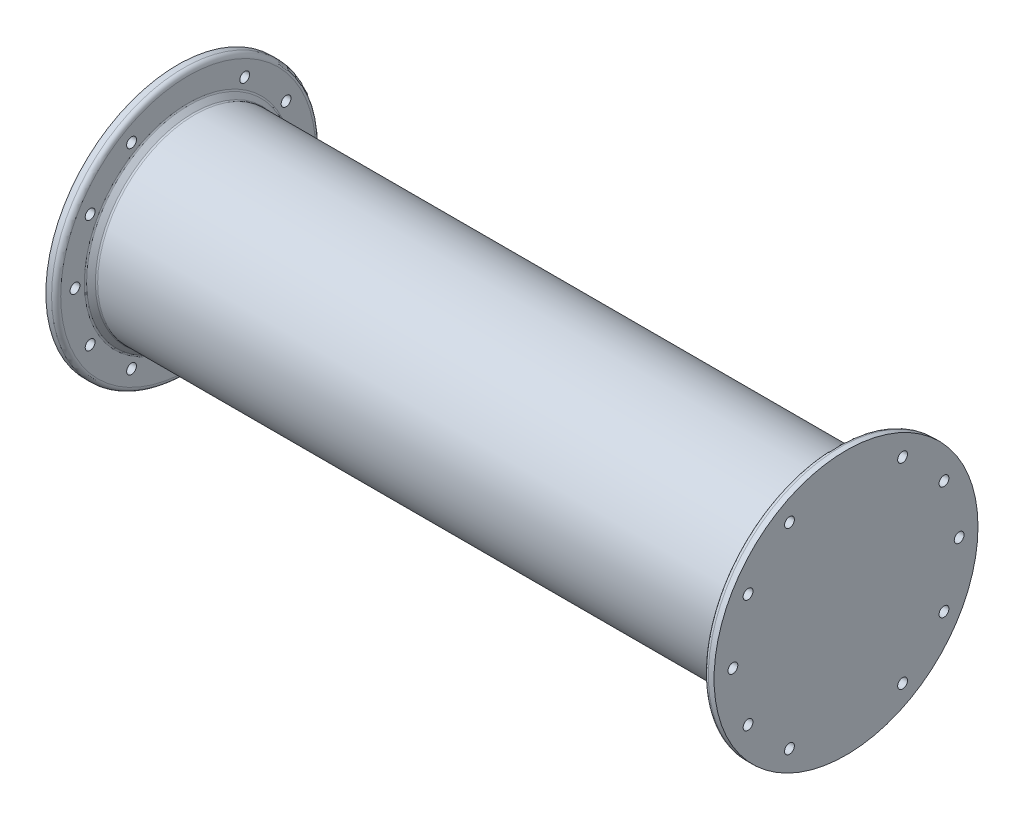
ISO-10303-21;
HEADER;
FILE_DESCRIPTION(('STEP AP214'),'2;1');
FILE_NAME('part.step','',(''),(''),'','','');
FILE_SCHEMA(('AUTOMOTIVE_DESIGN { 1 0 10303 214 1 1 1 1 }'));
ENDSEC;
DATA;
#1=APPLICATION_CONTEXT('core data for automotive mechanical design processes');
#2=APPLICATION_PROTOCOL_DEFINITION('international standard','automotive_design',2000,#1);
#3=PRODUCT_CONTEXT('',#1,'mechanical');
#4=PRODUCT('Part','Part','',(#3));
#5=PRODUCT_RELATED_PRODUCT_CATEGORY('part','',(#4));
#6=PRODUCT_DEFINITION_FORMATION('','',#4);
#7=PRODUCT_DEFINITION_CONTEXT('part definition',#1,'design');
#8=PRODUCT_DEFINITION('design','',#6,#7);
#9=PRODUCT_DEFINITION_SHAPE('','',#8);
#10=(LENGTH_UNIT() NAMED_UNIT(*) SI_UNIT(.MILLI.,.METRE.));
#11=(NAMED_UNIT(*) PLANE_ANGLE_UNIT() SI_UNIT($,.RADIAN.));
#12=(NAMED_UNIT(*) SI_UNIT($,.STERADIAN.) SOLID_ANGLE_UNIT());
#13=UNCERTAINTY_MEASURE_WITH_UNIT(LENGTH_MEASURE(1.E-05),#10,'distance_accuracy_value','');
#14=(GEOMETRIC_REPRESENTATION_CONTEXT(3) GLOBAL_UNCERTAINTY_ASSIGNED_CONTEXT((#13)) GLOBAL_UNIT_ASSIGNED_CONTEXT((#10,
#11,#12)) REPRESENTATION_CONTEXT('',''));
#15=CARTESIAN_POINT('',(0.,0.,0.));
#16=DIRECTION('',(0.,0.,1.));
#17=DIRECTION('',(1.,0.,0.));
#18=AXIS2_PLACEMENT_3D('',#15,#16,#17);
#19=CARTESIAN_POINT('',(0.,0.,0.));
#20=DIRECTION('',(1.,0.,0.));
#21=DIRECTION('',(0.,0.,-1.));
#22=AXIS2_PLACEMENT_3D('',#19,#20,#21);
#23=CYLINDRICAL_SURFACE('',#22,57.75);
#24=CARTESIAN_POINT('',(-146.2,0.,0.));
#25=DIRECTION('',(1.,0.,0.));
#26=DIRECTION('',(0.,0.,-1.));
#27=AXIS2_PLACEMENT_3D('',#24,#25,#26);
#28=CIRCLE('',#27,57.75);
#29=CARTESIAN_POINT('',(-146.2,0.,-57.75));
#30=VERTEX_POINT('',#29);
#31=EDGE_CURVE('E390',#30,#30,#28,.T.);
#32=ORIENTED_EDGE('',*,*,#31,.T.);
#33=EDGE_LOOP('',(#32));
#34=FACE_BOUND('',#33,.T.);
#35=CARTESIAN_POINT('',(-143.7,0.,0.));
#36=DIRECTION('',(-1.,0.,0.));
#37=DIRECTION('',(0.,0.,1.));
#38=AXIS2_PLACEMENT_3D('',#35,#36,#37);
#39=CIRCLE('',#38,57.75);
#40=CARTESIAN_POINT('',(-143.7,0.,57.75));
#41=VERTEX_POINT('',#40);
#42=EDGE_CURVE('E269',#41,#41,#39,.F.);
#43=ORIENTED_EDGE('',*,*,#42,.F.);
#44=EDGE_LOOP('',(#43));
#45=FACE_BOUND('',#44,.T.);
#46=ADVANCED_FACE('F16',(#34,#45),#23,.T.);
#47=CARTESIAN_POINT('',(-146.2,-56.,0.));
#48=DIRECTION('',(1.,0.,0.));
#49=DIRECTION('',(0.,0.,-1.));
#50=AXIS2_PLACEMENT_3D('',#47,#48,#49);
#51=PLANE('',#50);
#52=CARTESIAN_POINT('',(-146.2,1.84952029277756E-13,-49.5));
#53=DIRECTION('',(1.,0.,0.));
#54=DIRECTION('',(0.,0.,-1.));
#55=AXIS2_PLACEMENT_3D('',#52,#53,#54);
#56=CIRCLE('',#55,2.14999999999999);
#57=CARTESIAN_POINT('',(-146.2,1.84952029277756E-13,-51.65));
#58=VERTEX_POINT('',#57);
#59=EDGE_CURVE('E368',#58,#58,#56,.T.);
#60=ORIENTED_EDGE('',*,*,#59,.T.);
#61=EDGE_LOOP('',(#60));
#62=FACE_BOUND('',#61,.T.);
#63=CARTESIAN_POINT('',(-146.2,42.8682574873299,-24.7499999999997));
#64=DIRECTION('',(1.,0.,0.));
#65=DIRECTION('',(0.,0.,-1.));
#66=AXIS2_PLACEMENT_3D('',#63,#64,#65);
#67=CIRCLE('',#66,2.14999999999999);
#68=CARTESIAN_POINT('',(-146.2,42.8682574873299,-26.8999999999997));
#69=VERTEX_POINT('',#68);
#70=EDGE_CURVE('E362',#69,#69,#67,.T.);
#71=ORIENTED_EDGE('',*,*,#70,.T.);
#72=EDGE_LOOP('',(#71));
#73=FACE_BOUND('',#72,.T.);
#74=CARTESIAN_POINT('',(-146.2,24.7499999999996,42.86825748733));
#75=DIRECTION('',(1.,0.,0.));
#76=DIRECTION('',(0.,0.,-1.));
#77=AXIS2_PLACEMENT_3D('',#74,#75,#76);
#78=CIRCLE('',#77,2.14999999999999);
#79=CARTESIAN_POINT('',(-146.2,24.7499999999996,40.71825748733));
#80=VERTEX_POINT('',#79);
#81=EDGE_CURVE('E374',#80,#80,#78,.T.);
#82=ORIENTED_EDGE('',*,*,#81,.T.);
#83=EDGE_LOOP('',(#82));
#84=FACE_BOUND('',#83,.T.);
#85=CARTESIAN_POINT('',(-146.2,-24.7500000000005,42.8682574873294));
#86=DIRECTION('',(1.,0.,0.));
#87=DIRECTION('',(0.,0.,-1.));
#88=AXIS2_PLACEMENT_3D('',#85,#86,#87);
#89=CIRCLE('',#88,2.14999999999999);
#90=CARTESIAN_POINT('',(-146.2,-24.7500000000005,40.7182574873294));
#91=VERTEX_POINT('',#90);
#92=EDGE_CURVE('E380',#91,#91,#89,.T.);
#93=ORIENTED_EDGE('',*,*,#92,.T.);
#94=EDGE_LOOP('',(#93));
#95=FACE_BOUND('',#94,.T.);
#96=CARTESIAN_POINT('',(-146.2,-42.8682574873293,-24.7500000000007));
#97=DIRECTION('',(1.,0.,0.));
#98=DIRECTION('',(0.,0.,-1.));
#99=AXIS2_PLACEMENT_3D('',#96,#97,#98);
#100=CIRCLE('',#99,2.14999999999999);
#101=CARTESIAN_POINT('',(-146.2,-42.8682574873293,-26.9000000000007));
#102=VERTEX_POINT('',#101);
#103=EDGE_CURVE('E268',#102,#102,#100,.T.);
#104=ORIENTED_EDGE('',*,*,#103,.T.);
#105=EDGE_LOOP('',(#104));
#106=FACE_BOUND('',#105,.T.);
#107=CARTESIAN_POINT('',(-146.2,-24.7499999999993,-42.8682574873301));
#108=DIRECTION('',(1.,0.,0.));
#109=DIRECTION('',(0.,0.,-1.));
#110=AXIS2_PLACEMENT_3D('',#107,#108,#109);
#111=CIRCLE('',#110,2.14999999999999);
#112=CARTESIAN_POINT('',(-146.2,-24.7499999999993,-45.0182574873301));
#113=VERTEX_POINT('',#112);
#114=EDGE_CURVE('E272',#113,#113,#111,.T.);
#115=ORIENTED_EDGE('',*,*,#114,.T.);
#116=EDGE_LOOP('',(#115));
#117=FACE_BOUND('',#116,.T.);
#118=CARTESIAN_POINT('',(-146.2,-42.86825748733,24.7499999999994));
#119=DIRECTION('',(1.,0.,0.));
#120=DIRECTION('',(0.,0.,-1.));
#121=AXIS2_PLACEMENT_3D('',#118,#119,#120);
#122=CIRCLE('',#121,2.14999999999999);
#123=CARTESIAN_POINT('',(-146.2,-42.86825748733,22.5999999999995));
#124=VERTEX_POINT('',#123);
#125=EDGE_CURVE('E383',#124,#124,#122,.T.);
#126=ORIENTED_EDGE('',*,*,#125,.T.);
#127=EDGE_LOOP('',(#126));
#128=FACE_BOUND('',#127,.T.);
#129=CARTESIAN_POINT('',(-146.2,-5.30608882027585E-13,49.5));
#130=DIRECTION('',(1.,0.,0.));
#131=DIRECTION('',(0.,0.,-1.));
#132=AXIS2_PLACEMENT_3D('',#129,#130,#131);
#133=CIRCLE('',#132,2.14999999999999);
#134=CARTESIAN_POINT('',(-146.2,-5.30608882027585E-13,47.35));
#135=VERTEX_POINT('',#134);
#136=EDGE_CURVE('E377',#135,#135,#133,.T.);
#137=ORIENTED_EDGE('',*,*,#136,.T.);
#138=EDGE_LOOP('',(#137));
#139=FACE_BOUND('',#138,.T.);
#140=CARTESIAN_POINT('',(-146.2,42.8682574873295,24.7500000000004));
#141=DIRECTION('',(1.,0.,0.));
#142=DIRECTION('',(0.,0.,-1.));
#143=AXIS2_PLACEMENT_3D('',#140,#141,#142);
#144=CIRCLE('',#143,2.14999999999999);
#145=CARTESIAN_POINT('',(-146.2,42.8682574873295,22.6000000000004));
#146=VERTEX_POINT('',#145);
#147=EDGE_CURVE('E371',#146,#146,#144,.T.);
#148=ORIENTED_EDGE('',*,*,#147,.T.);
#149=EDGE_LOOP('',(#148));
#150=FACE_BOUND('',#149,.T.);
#151=CARTESIAN_POINT('',(-146.2,24.7500000000002,-42.8682574873296));
#152=DIRECTION('',(1.,0.,0.));
#153=DIRECTION('',(0.,0.,-1.));
#154=AXIS2_PLACEMENT_3D('',#151,#152,#153);
#155=CIRCLE('',#154,2.14999999999999);
#156=CARTESIAN_POINT('',(-146.2,24.7500000000002,-45.0182574873296));
#157=VERTEX_POINT('',#156);
#158=EDGE_CURVE('E365',#157,#157,#155,.T.);
#159=ORIENTED_EDGE('',*,*,#158,.T.);
#160=EDGE_LOOP('',(#159));
#161=FACE_BOUND('',#160,.T.);
#162=ORIENTED_EDGE('',*,*,#31,.F.);
#163=EDGE_LOOP('',(#162));
#164=FACE_BOUND('',#163,.T.);
#165=ADVANCED_FACE('F686',(#62,#73,#84,#95,#106,#117,#128,#139,#150,#161,#164),#51,.F.);
#166=CARTESIAN_POINT('',(0.,0.,0.));
#167=DIRECTION('',(1.,0.,0.));
#168=DIRECTION('',(0.,0.,-1.));
#169=AXIS2_PLACEMENT_3D('',#166,#167,#168);
#170=CYLINDRICAL_SURFACE('',#169,57.75);
#171=CARTESIAN_POINT('',(143.7,0.,0.));
#172=DIRECTION('',(1.,0.,0.));
#173=DIRECTION('',(0.,0.,-1.));
#174=AXIS2_PLACEMENT_3D('',#171,#172,#173);
#175=CIRCLE('',#174,57.75);
#176=CARTESIAN_POINT('',(143.7,0.,-57.75));
#177=VERTEX_POINT('',#176);
#178=EDGE_CURVE('E259',#177,#177,#175,.F.);
#179=ORIENTED_EDGE('',*,*,#178,.F.);
#180=EDGE_LOOP('',(#179));
#181=FACE_BOUND('',#180,.T.);
#182=CARTESIAN_POINT('',(146.2,0.,0.));
#183=DIRECTION('',(1.,0.,0.));
#184=DIRECTION('',(0.,0.,-1.));
#185=AXIS2_PLACEMENT_3D('',#182,#183,#184);
#186=CIRCLE('',#185,57.75);
#187=CARTESIAN_POINT('',(146.2,0.,-57.75));
#188=VERTEX_POINT('',#187);
#189=EDGE_CURVE('E273',#188,#188,#186,.F.);
#190=ORIENTED_EDGE('',*,*,#189,.T.);
#191=EDGE_LOOP('',(#190));
#192=FACE_BOUND('',#191,.T.);
#193=ADVANCED_FACE('F677',(#181,#192),#170,.T.);
#194=CARTESIAN_POINT('',(146.2,-56.,0.));
#195=DIRECTION('',(-1.,0.,0.));
#196=DIRECTION('',(0.,0.,1.));
#197=AXIS2_PLACEMENT_3D('',#194,#195,#196);
#198=PLANE('',#197);
#199=CARTESIAN_POINT('',(146.2,1.84952029277756E-13,-49.5));
#200=DIRECTION('',(-1.,0.,0.));
#201=DIRECTION('',(0.,0.,1.));
#202=AXIS2_PLACEMENT_3D('',#199,#200,#201);
#203=CIRCLE('',#202,2.14999999999999);
#204=CARTESIAN_POINT('',(146.2,1.84952029277756E-13,-47.35));
#205=VERTEX_POINT('',#204);
#206=EDGE_CURVE('E343',#205,#205,#203,.T.);
#207=ORIENTED_EDGE('',*,*,#206,.T.);
#208=EDGE_LOOP('',(#207));
#209=FACE_BOUND('',#208,.T.);
#210=CARTESIAN_POINT('',(146.2,42.8682574873299,-24.7499999999997));
#211=DIRECTION('',(-1.,0.,0.));
#212=DIRECTION('',(0.,0.,1.));
#213=AXIS2_PLACEMENT_3D('',#210,#211,#212);
#214=CIRCLE('',#213,2.14999999999999);
#215=CARTESIAN_POINT('',(146.2,42.8682574873299,-22.5999999999997));
#216=VERTEX_POINT('',#215);
#217=EDGE_CURVE('E349',#216,#216,#214,.T.);
#218=ORIENTED_EDGE('',*,*,#217,.T.);
#219=EDGE_LOOP('',(#218));
#220=FACE_BOUND('',#219,.T.);
#221=CARTESIAN_POINT('',(146.2,24.7499999999996,42.86825748733));
#222=DIRECTION('',(-1.,0.,0.));
#223=DIRECTION('',(0.,0.,1.));
#224=AXIS2_PLACEMENT_3D('',#221,#222,#223);
#225=CIRCLE('',#224,2.14999999999999);
#226=CARTESIAN_POINT('',(146.2,24.7499999999996,45.0182574873299));
#227=VERTEX_POINT('',#226);
#228=EDGE_CURVE('E355',#227,#227,#225,.T.);
#229=ORIENTED_EDGE('',*,*,#228,.T.);
#230=EDGE_LOOP('',(#229));
#231=FACE_BOUND('',#230,.T.);
#232=CARTESIAN_POINT('',(146.2,-24.7500000000005,42.8682574873294));
#233=DIRECTION('',(-1.,0.,0.));
#234=DIRECTION('',(0.,0.,1.));
#235=AXIS2_PLACEMENT_3D('',#232,#233,#234);
#236=CIRCLE('',#235,2.14999999999999);
#237=CARTESIAN_POINT('',(146.2,-24.7500000000005,45.0182574873294));
#238=VERTEX_POINT('',#237);
#239=EDGE_CURVE('E337',#238,#238,#236,.T.);
#240=ORIENTED_EDGE('',*,*,#239,.T.);
#241=EDGE_LOOP('',(#240));
#242=FACE_BOUND('',#241,.T.);
#243=CARTESIAN_POINT('',(146.2,-42.8682574873293,-24.7500000000007));
#244=DIRECTION('',(-1.,0.,0.));
#245=DIRECTION('',(0.,0.,1.));
#246=AXIS2_PLACEMENT_3D('',#243,#244,#245);
#247=CIRCLE('',#246,2.14999999999999);
#248=CARTESIAN_POINT('',(146.2,-42.8682574873293,-22.6000000000007));
#249=VERTEX_POINT('',#248);
#250=EDGE_CURVE('E267',#249,#249,#247,.T.);
#251=ORIENTED_EDGE('',*,*,#250,.T.);
#252=EDGE_LOOP('',(#251));
#253=FACE_BOUND('',#252,.T.);
#254=CARTESIAN_POINT('',(146.2,-24.7499999999993,-42.8682574873301));
#255=DIRECTION('',(-1.,0.,0.));
#256=DIRECTION('',(0.,0.,1.));
#257=AXIS2_PLACEMENT_3D('',#254,#255,#256);
#258=CIRCLE('',#257,2.14999999999999);
#259=CARTESIAN_POINT('',(146.2,-24.7499999999993,-40.7182574873301));
#260=VERTEX_POINT('',#259);
#261=EDGE_CURVE('E64',#260,#260,#258,.T.);
#262=ORIENTED_EDGE('',*,*,#261,.T.);
#263=EDGE_LOOP('',(#262));
#264=FACE_BOUND('',#263,.T.);
#265=CARTESIAN_POINT('',(146.2,-42.86825748733,24.7499999999994));
#266=DIRECTION('',(-1.,0.,0.));
#267=DIRECTION('',(0.,0.,1.));
#268=AXIS2_PLACEMENT_3D('',#265,#266,#267);
#269=CIRCLE('',#268,2.14999999999999);
#270=CARTESIAN_POINT('',(146.2,-42.86825748733,26.8999999999994));
#271=VERTEX_POINT('',#270);
#272=EDGE_CURVE('E334',#271,#271,#269,.T.);
#273=ORIENTED_EDGE('',*,*,#272,.T.);
#274=EDGE_LOOP('',(#273));
#275=FACE_BOUND('',#274,.T.);
#276=CARTESIAN_POINT('',(146.2,-5.30608882027585E-13,49.5));
#277=DIRECTION('',(-1.,0.,0.));
#278=DIRECTION('',(0.,0.,1.));
#279=AXIS2_PLACEMENT_3D('',#276,#277,#278);
#280=CIRCLE('',#279,2.14999999999999);
#281=CARTESIAN_POINT('',(146.2,-5.30608882027585E-13,51.65));
#282=VERTEX_POINT('',#281);
#283=EDGE_CURVE('E340',#282,#282,#280,.T.);
#284=ORIENTED_EDGE('',*,*,#283,.T.);
#285=EDGE_LOOP('',(#284));
#286=FACE_BOUND('',#285,.T.);
#287=CARTESIAN_POINT('',(146.2,42.8682574873295,24.7500000000004));
#288=DIRECTION('',(-1.,0.,0.));
#289=DIRECTION('',(0.,0.,1.));
#290=AXIS2_PLACEMENT_3D('',#287,#288,#289);
#291=CIRCLE('',#290,2.14999999999999);
#292=CARTESIAN_POINT('',(146.2,42.8682574873295,26.9000000000004));
#293=VERTEX_POINT('',#292);
#294=EDGE_CURVE('E352',#293,#293,#291,.T.);
#295=ORIENTED_EDGE('',*,*,#294,.T.);
#296=EDGE_LOOP('',(#295));
#297=FACE_BOUND('',#296,.T.);
#298=CARTESIAN_POINT('',(146.2,24.7500000000002,-42.8682574873296));
#299=DIRECTION('',(-1.,0.,0.));
#300=DIRECTION('',(0.,0.,1.));
#301=AXIS2_PLACEMENT_3D('',#298,#299,#300);
#302=CIRCLE('',#301,2.14999999999999);
#303=CARTESIAN_POINT('',(146.2,24.7500000000002,-40.7182574873296));
#304=VERTEX_POINT('',#303);
#305=EDGE_CURVE('E346',#304,#304,#302,.T.);
#306=ORIENTED_EDGE('',*,*,#305,.T.);
#307=EDGE_LOOP('',(#306));
#308=FACE_BOUND('',#307,.T.);
#309=ORIENTED_EDGE('',*,*,#189,.F.);
#310=EDGE_LOOP('',(#309));
#311=FACE_BOUND('',#310,.T.);
#312=ADVANCED_FACE('F252',(#209,#220,#231,#242,#253,#264,#275,#286,#297,#308,#311),#198,.F.);
#313=CARTESIAN_POINT('',(-143.7,0.,0.));
#314=DIRECTION('',(-1.,0.,0.));
#315=DIRECTION('',(0.,0.,1.));
#316=AXIS2_PLACEMENT_3D('',#313,#314,#315);
#317=TOROIDAL_SURFACE('',#316,55.75,2.);
#318=CARTESIAN_POINT('',(-141.7,0.,0.));
#319=DIRECTION('',(-1.,0.,0.));
#320=DIRECTION('',(0.,0.,1.));
#321=AXIS2_PLACEMENT_3D('',#318,#319,#320);
#322=CIRCLE('',#321,55.75);
#323=CARTESIAN_POINT('',(-141.7,0.,55.75));
#324=VERTEX_POINT('',#323);
#325=CARTESIAN_POINT('',(-141.7,0.,-55.75));
#326=VERTEX_POINT('',#325);
#327=EDGE_CURVE('E59',#324,#326,#322,.T.);
#328=ORIENTED_EDGE('',*,*,#327,.T.);
#329=CARTESIAN_POINT('',(-141.7,0.,0.));
#330=DIRECTION('',(-1.,0.,0.));
#331=DIRECTION('',(0.,0.,-1.));
#332=AXIS2_PLACEMENT_3D('',#329,#330,#331);
#333=CIRCLE('',#332,55.75);
#334=EDGE_CURVE('E56',#326,#324,#333,.T.);
#335=ORIENTED_EDGE('',*,*,#334,.T.);
#336=EDGE_LOOP('',(#328,#335));
#337=FACE_BOUND('',#336,.T.);
#338=ORIENTED_EDGE('',*,*,#42,.T.);
#339=EDGE_LOOP('',(#338));
#340=FACE_BOUND('',#339,.T.);
#341=ADVANCED_FACE('F60',(#337,#340),#317,.T.);
#342=CARTESIAN_POINT('',(-141.7,-24.7499999999993,-42.8682574873301));
#343=DIRECTION('',(1.,0.,0.));
#344=DIRECTION('',(0.,0.,-1.));
#345=AXIS2_PLACEMENT_3D('',#342,#343,#344);
#346=CYLINDRICAL_SURFACE('',#345,2.14999999999999);
#347=ORIENTED_EDGE('',*,*,#114,.F.);
#348=EDGE_LOOP('',(#347));
#349=FACE_BOUND('',#348,.T.);
#350=CARTESIAN_POINT('',(-141.7,-24.7499999999993,-42.8682574873301));
#351=DIRECTION('',(1.,0.,0.));
#352=DIRECTION('',(0.,0.,-1.));
#353=AXIS2_PLACEMENT_3D('',#350,#351,#352);
#354=CIRCLE('',#353,2.14999999999999);
#355=CARTESIAN_POINT('',(-141.7,-24.7499999999993,-45.0182574873301));
#356=VERTEX_POINT('',#355);
#357=EDGE_CURVE('E69',#356,#356,#354,.T.);
#358=ORIENTED_EDGE('',*,*,#357,.T.);
#359=EDGE_LOOP('',(#358));
#360=FACE_BOUND('',#359,.T.);
#361=ADVANCED_FACE('F251',(#349,#360),#346,.F.);
#362=CARTESIAN_POINT('',(-141.7,-42.86825748733,24.7499999999994));
#363=DIRECTION('',(1.,0.,0.));
#364=DIRECTION('',(0.,0.,-1.));
#365=AXIS2_PLACEMENT_3D('',#362,#363,#364);
#366=CYLINDRICAL_SURFACE('',#365,2.14999999999999);
#367=ORIENTED_EDGE('',*,*,#125,.F.);
#368=EDGE_LOOP('',(#367));
#369=FACE_BOUND('',#368,.T.);
#370=CARTESIAN_POINT('',(-141.7,-42.86825748733,24.7499999999994));
#371=DIRECTION('',(1.,0.,0.));
#372=DIRECTION('',(0.,0.,-1.));
#373=AXIS2_PLACEMENT_3D('',#370,#371,#372);
#374=CIRCLE('',#373,2.14999999999999);
#375=CARTESIAN_POINT('',(-141.7,-42.86825748733,22.5999999999995));
#376=VERTEX_POINT('',#375);
#377=EDGE_CURVE('E327',#376,#376,#374,.T.);
#378=ORIENTED_EDGE('',*,*,#377,.T.);
#379=EDGE_LOOP('',(#378));
#380=FACE_BOUND('',#379,.T.);
#381=ADVANCED_FACE('F645',(#369,#380),#366,.F.);
#382=CARTESIAN_POINT('',(-141.7,-24.7500000000005,42.8682574873294));
#383=DIRECTION('',(1.,0.,0.));
#384=DIRECTION('',(0.,0.,-1.));
#385=AXIS2_PLACEMENT_3D('',#382,#383,#384);
#386=CYLINDRICAL_SURFACE('',#385,2.14999999999999);
#387=ORIENTED_EDGE('',*,*,#92,.F.);
#388=EDGE_LOOP('',(#387));
#389=FACE_BOUND('',#388,.T.);
#390=CARTESIAN_POINT('',(-141.7,-24.7500000000005,42.8682574873294));
#391=DIRECTION('',(1.,0.,0.));
#392=DIRECTION('',(0.,0.,-1.));
#393=AXIS2_PLACEMENT_3D('',#390,#391,#392);
#394=CIRCLE('',#393,2.14999999999999);
#395=CARTESIAN_POINT('',(-141.7,-24.7500000000005,40.7182574873294));
#396=VERTEX_POINT('',#395);
#397=EDGE_CURVE('E324',#396,#396,#394,.T.);
#398=ORIENTED_EDGE('',*,*,#397,.T.);
#399=EDGE_LOOP('',(#398));
#400=FACE_BOUND('',#399,.T.);
#401=ADVANCED_FACE('F635',(#389,#400),#386,.F.);
#402=CARTESIAN_POINT('',(-141.7,-5.30608882027585E-13,49.5));
#403=DIRECTION('',(1.,0.,0.));
#404=DIRECTION('',(0.,0.,-1.));
#405=AXIS2_PLACEMENT_3D('',#402,#403,#404);
#406=CYLINDRICAL_SURFACE('',#405,2.14999999999999);
#407=ORIENTED_EDGE('',*,*,#136,.F.);
#408=EDGE_LOOP('',(#407));
#409=FACE_BOUND('',#408,.T.);
#410=CARTESIAN_POINT('',(-141.7,-5.30608882027585E-13,49.5));
#411=DIRECTION('',(1.,0.,0.));
#412=DIRECTION('',(0.,0.,-1.));
#413=AXIS2_PLACEMENT_3D('',#410,#411,#412);
#414=CIRCLE('',#413,2.14999999999999);
#415=CARTESIAN_POINT('',(-141.7,-5.30608882027585E-13,47.35));
#416=VERTEX_POINT('',#415);
#417=EDGE_CURVE('E321',#416,#416,#414,.T.);
#418=ORIENTED_EDGE('',*,*,#417,.T.);
#419=EDGE_LOOP('',(#418));
#420=FACE_BOUND('',#419,.T.);
#421=ADVANCED_FACE('F625',(#409,#420),#406,.F.);
#422=CARTESIAN_POINT('',(-141.7,24.7499999999996,42.86825748733));
#423=DIRECTION('',(1.,0.,0.));
#424=DIRECTION('',(0.,0.,-1.));
#425=AXIS2_PLACEMENT_3D('',#422,#423,#424);
#426=CYLINDRICAL_SURFACE('',#425,2.14999999999999);
#427=ORIENTED_EDGE('',*,*,#81,.F.);
#428=EDGE_LOOP('',(#427));
#429=FACE_BOUND('',#428,.T.);
#430=CARTESIAN_POINT('',(-141.7,24.7499999999996,42.86825748733));
#431=DIRECTION('',(1.,0.,0.));
#432=DIRECTION('',(0.,0.,-1.));
#433=AXIS2_PLACEMENT_3D('',#430,#431,#432);
#434=CIRCLE('',#433,2.14999999999999);
#435=CARTESIAN_POINT('',(-141.7,24.7499999999996,40.71825748733));
#436=VERTEX_POINT('',#435);
#437=EDGE_CURVE('E318',#436,#436,#434,.T.);
#438=ORIENTED_EDGE('',*,*,#437,.T.);
#439=EDGE_LOOP('',(#438));
#440=FACE_BOUND('',#439,.T.);
#441=ADVANCED_FACE('F615',(#429,#440),#426,.F.);
#442=CARTESIAN_POINT('',(-141.7,42.8682574873295,24.7500000000004));
#443=DIRECTION('',(1.,0.,0.));
#444=DIRECTION('',(0.,0.,-1.));
#445=AXIS2_PLACEMENT_3D('',#442,#443,#444);
#446=CYLINDRICAL_SURFACE('',#445,2.14999999999999);
#447=ORIENTED_EDGE('',*,*,#147,.F.);
#448=EDGE_LOOP('',(#447));
#449=FACE_BOUND('',#448,.T.);
#450=CARTESIAN_POINT('',(-141.7,42.8682574873295,24.7500000000004));
#451=DIRECTION('',(1.,0.,0.));
#452=DIRECTION('',(0.,0.,-1.));
#453=AXIS2_PLACEMENT_3D('',#450,#451,#452);
#454=CIRCLE('',#453,2.14999999999999);
#455=CARTESIAN_POINT('',(-141.7,42.8682574873295,22.6000000000004));
#456=VERTEX_POINT('',#455);
#457=EDGE_CURVE('E315',#456,#456,#454,.T.);
#458=ORIENTED_EDGE('',*,*,#457,.T.);
#459=EDGE_LOOP('',(#458));
#460=FACE_BOUND('',#459,.T.);
#461=ADVANCED_FACE('F605',(#449,#460),#446,.F.);
#462=CARTESIAN_POINT('',(-141.7,1.84952029277756E-13,-49.5));
#463=DIRECTION('',(1.,0.,0.));
#464=DIRECTION('',(0.,0.,-1.));
#465=AXIS2_PLACEMENT_3D('',#462,#463,#464);
#466=CYLINDRICAL_SURFACE('',#465,2.14999999999999);
#467=ORIENTED_EDGE('',*,*,#59,.F.);
#468=EDGE_LOOP('',(#467));
#469=FACE_BOUND('',#468,.T.);
#470=CARTESIAN_POINT('',(-141.7,1.84952029277756E-13,-49.5));
#471=DIRECTION('',(1.,0.,0.));
#472=DIRECTION('',(0.,0.,-1.));
#473=AXIS2_PLACEMENT_3D('',#470,#471,#472);
#474=CIRCLE('',#473,2.14999999999999);
#475=CARTESIAN_POINT('',(-141.7,1.84952029277756E-13,-51.65));
#476=VERTEX_POINT('',#475);
#477=EDGE_CURVE('E312',#476,#476,#474,.T.);
#478=ORIENTED_EDGE('',*,*,#477,.T.);
#479=EDGE_LOOP('',(#478));
#480=FACE_BOUND('',#479,.T.);
#481=ADVANCED_FACE('F595',(#469,#480),#466,.F.);
#482=CARTESIAN_POINT('',(-141.7,24.7500000000002,-42.8682574873296));
#483=DIRECTION('',(1.,0.,0.));
#484=DIRECTION('',(0.,0.,-1.));
#485=AXIS2_PLACEMENT_3D('',#482,#483,#484);
#486=CYLINDRICAL_SURFACE('',#485,2.14999999999999);
#487=ORIENTED_EDGE('',*,*,#158,.F.);
#488=EDGE_LOOP('',(#487));
#489=FACE_BOUND('',#488,.T.);
#490=CARTESIAN_POINT('',(-141.7,24.7500000000002,-42.8682574873296));
#491=DIRECTION('',(1.,0.,0.));
#492=DIRECTION('',(0.,0.,-1.));
#493=AXIS2_PLACEMENT_3D('',#490,#491,#492);
#494=CIRCLE('',#493,2.14999999999999);
#495=CARTESIAN_POINT('',(-141.7,24.7500000000002,-45.0182574873296));
#496=VERTEX_POINT('',#495);
#497=EDGE_CURVE('E309',#496,#496,#494,.T.);
#498=ORIENTED_EDGE('',*,*,#497,.T.);
#499=EDGE_LOOP('',(#498));
#500=FACE_BOUND('',#499,.T.);
#501=ADVANCED_FACE('F586',(#489,#500),#486,.F.);
#502=CARTESIAN_POINT('',(-141.7,42.8682574873299,-24.7499999999997));
#503=DIRECTION('',(1.,0.,0.));
#504=DIRECTION('',(0.,0.,-1.));
#505=AXIS2_PLACEMENT_3D('',#502,#503,#504);
#506=CYLINDRICAL_SURFACE('',#505,2.14999999999999);
#507=ORIENTED_EDGE('',*,*,#70,.F.);
#508=EDGE_LOOP('',(#507));
#509=FACE_BOUND('',#508,.T.);
#510=CARTESIAN_POINT('',(-141.7,42.8682574873299,-24.7499999999997));
#511=DIRECTION('',(1.,0.,0.));
#512=DIRECTION('',(0.,0.,-1.));
#513=AXIS2_PLACEMENT_3D('',#510,#511,#512);
#514=CIRCLE('',#513,2.14999999999999);
#515=CARTESIAN_POINT('',(-141.7,42.8682574873299,-26.8999999999997));
#516=VERTEX_POINT('',#515);
#517=EDGE_CURVE('E306',#516,#516,#514,.T.);
#518=ORIENTED_EDGE('',*,*,#517,.T.);
#519=EDGE_LOOP('',(#518));
#520=FACE_BOUND('',#519,.T.);
#521=ADVANCED_FACE('F577',(#509,#520),#506,.F.);
#522=CARTESIAN_POINT('',(-141.7,-42.8682574873293,-24.7500000000007));
#523=DIRECTION('',(1.,0.,0.));
#524=DIRECTION('',(0.,0.,-1.));
#525=AXIS2_PLACEMENT_3D('',#522,#523,#524);
#526=CYLINDRICAL_SURFACE('',#525,2.14999999999999);
#527=ORIENTED_EDGE('',*,*,#103,.F.);
#528=EDGE_LOOP('',(#527));
#529=FACE_BOUND('',#528,.T.);
#530=CARTESIAN_POINT('',(-141.7,-42.8682574873293,-24.7500000000007));
#531=DIRECTION('',(1.,0.,0.));
#532=DIRECTION('',(0.,0.,-1.));
#533=AXIS2_PLACEMENT_3D('',#530,#531,#532);
#534=CIRCLE('',#533,2.14999999999999);
#535=CARTESIAN_POINT('',(-141.7,-42.8682574873293,-26.9000000000007));
#536=VERTEX_POINT('',#535);
#537=EDGE_CURVE('E303',#536,#536,#534,.T.);
#538=ORIENTED_EDGE('',*,*,#537,.T.);
#539=EDGE_LOOP('',(#538));
#540=FACE_BOUND('',#539,.T.);
#541=ADVANCED_FACE('F225',(#529,#540),#526,.F.);
#542=CARTESIAN_POINT('',(143.7,0.,0.));
#543=DIRECTION('',(1.,0.,0.));
#544=DIRECTION('',(0.,0.,-1.));
#545=AXIS2_PLACEMENT_3D('',#542,#543,#544);
#546=TOROIDAL_SURFACE('',#545,55.75,2.);
#547=CARTESIAN_POINT('',(141.7,0.,0.));
#548=DIRECTION('',(1.,0.,0.));
#549=DIRECTION('',(0.,0.,-1.));
#550=AXIS2_PLACEMENT_3D('',#547,#548,#549);
#551=CIRCLE('',#550,55.75);
#552=CARTESIAN_POINT('',(141.7,0.,-55.75));
#553=VERTEX_POINT('',#552);
#554=CARTESIAN_POINT('',(141.7,0.,55.75));
#555=VERTEX_POINT('',#554);
#556=EDGE_CURVE('E167',#553,#555,#551,.T.);
#557=ORIENTED_EDGE('',*,*,#556,.T.);
#558=CARTESIAN_POINT('',(141.7,0.,0.));
#559=DIRECTION('',(1.,0.,0.));
#560=DIRECTION('',(0.,0.,1.));
#561=AXIS2_PLACEMENT_3D('',#558,#559,#560);
#562=CIRCLE('',#561,55.75);
#563=EDGE_CURVE('E177',#555,#553,#562,.T.);
#564=ORIENTED_EDGE('',*,*,#563,.T.);
#565=EDGE_LOOP('',(#557,#564));
#566=FACE_BOUND('',#565,.T.);
#567=ORIENTED_EDGE('',*,*,#178,.T.);
#568=EDGE_LOOP('',(#567));
#569=FACE_BOUND('',#568,.T.);
#570=ADVANCED_FACE('F219',(#566,#569),#546,.T.);
#571=CARTESIAN_POINT('',(141.7,-42.8682574873293,-24.7500000000007));
#572=DIRECTION('',(-1.,0.,0.));
#573=DIRECTION('',(0.,0.,1.));
#574=AXIS2_PLACEMENT_3D('',#571,#572,#573);
#575=CYLINDRICAL_SURFACE('',#574,2.14999999999999);
#576=ORIENTED_EDGE('',*,*,#250,.F.);
#577=EDGE_LOOP('',(#576));
#578=FACE_BOUND('',#577,.T.);
#579=CARTESIAN_POINT('',(141.7,-42.8682574873293,-24.7500000000007));
#580=DIRECTION('',(-1.,0.,0.));
#581=DIRECTION('',(0.,0.,1.));
#582=AXIS2_PLACEMENT_3D('',#579,#580,#581);
#583=CIRCLE('',#582,2.14999999999999);
#584=CARTESIAN_POINT('',(141.7,-42.8682574873293,-22.6000000000007));
#585=VERTEX_POINT('',#584);
#586=EDGE_CURVE('E300',#585,#585,#583,.T.);
#587=ORIENTED_EDGE('',*,*,#586,.T.);
#588=EDGE_LOOP('',(#587));
#589=FACE_BOUND('',#588,.T.);
#590=ADVANCED_FACE('F224',(#578,#589),#575,.F.);
#591=CARTESIAN_POINT('',(141.7,24.7499999999996,42.86825748733));
#592=DIRECTION('',(-1.,0.,0.));
#593=DIRECTION('',(0.,0.,1.));
#594=AXIS2_PLACEMENT_3D('',#591,#592,#593);
#595=CYLINDRICAL_SURFACE('',#594,2.14999999999999);
#596=ORIENTED_EDGE('',*,*,#228,.F.);
#597=EDGE_LOOP('',(#596));
#598=FACE_BOUND('',#597,.T.);
#599=CARTESIAN_POINT('',(141.7,24.7499999999996,42.86825748733));
#600=DIRECTION('',(-1.,0.,0.));
#601=DIRECTION('',(0.,0.,1.));
#602=AXIS2_PLACEMENT_3D('',#599,#600,#601);
#603=CIRCLE('',#602,2.14999999999999);
#604=CARTESIAN_POINT('',(141.7,24.7499999999996,45.0182574873299));
#605=VERTEX_POINT('',#604);
#606=EDGE_CURVE('E297',#605,#605,#603,.T.);
#607=ORIENTED_EDGE('',*,*,#606,.T.);
#608=EDGE_LOOP('',(#607));
#609=FACE_BOUND('',#608,.T.);
#610=ADVANCED_FACE('F545',(#598,#609),#595,.F.);
#611=CARTESIAN_POINT('',(141.7,42.8682574873295,24.7500000000004));
#612=DIRECTION('',(-1.,0.,0.));
#613=DIRECTION('',(0.,0.,1.));
#614=AXIS2_PLACEMENT_3D('',#611,#612,#613);
#615=CYLINDRICAL_SURFACE('',#614,2.14999999999999);
#616=ORIENTED_EDGE('',*,*,#294,.F.);
#617=EDGE_LOOP('',(#616));
#618=FACE_BOUND('',#617,.T.);
#619=CARTESIAN_POINT('',(141.7,42.8682574873295,24.7500000000004));
#620=DIRECTION('',(-1.,0.,0.));
#621=DIRECTION('',(0.,0.,1.));
#622=AXIS2_PLACEMENT_3D('',#619,#620,#621);
#623=CIRCLE('',#622,2.14999999999999);
#624=CARTESIAN_POINT('',(141.7,42.8682574873295,26.9000000000004));
#625=VERTEX_POINT('',#624);
#626=EDGE_CURVE('E294',#625,#625,#623,.T.);
#627=ORIENTED_EDGE('',*,*,#626,.T.);
#628=EDGE_LOOP('',(#627));
#629=FACE_BOUND('',#628,.T.);
#630=ADVANCED_FACE('F535',(#618,#629),#615,.F.);
#631=CARTESIAN_POINT('',(141.7,42.8682574873299,-24.7499999999997));
#632=DIRECTION('',(-1.,0.,0.));
#633=DIRECTION('',(0.,0.,1.));
#634=AXIS2_PLACEMENT_3D('',#631,#632,#633);
#635=CYLINDRICAL_SURFACE('',#634,2.14999999999999);
#636=ORIENTED_EDGE('',*,*,#217,.F.);
#637=EDGE_LOOP('',(#636));
#638=FACE_BOUND('',#637,.T.);
#639=CARTESIAN_POINT('',(141.7,42.8682574873299,-24.7499999999997));
#640=DIRECTION('',(-1.,0.,0.));
#641=DIRECTION('',(0.,0.,1.));
#642=AXIS2_PLACEMENT_3D('',#639,#640,#641);
#643=CIRCLE('',#642,2.14999999999999);
#644=CARTESIAN_POINT('',(141.7,42.8682574873299,-22.5999999999997));
#645=VERTEX_POINT('',#644);
#646=EDGE_CURVE('E291',#645,#645,#643,.T.);
#647=ORIENTED_EDGE('',*,*,#646,.T.);
#648=EDGE_LOOP('',(#647));
#649=FACE_BOUND('',#648,.T.);
#650=ADVANCED_FACE('F525',(#638,#649),#635,.F.);
#651=CARTESIAN_POINT('',(141.7,24.7500000000002,-42.8682574873296));
#652=DIRECTION('',(-1.,0.,0.));
#653=DIRECTION('',(0.,0.,1.));
#654=AXIS2_PLACEMENT_3D('',#651,#652,#653);
#655=CYLINDRICAL_SURFACE('',#654,2.14999999999999);
#656=ORIENTED_EDGE('',*,*,#305,.F.);
#657=EDGE_LOOP('',(#656));
#658=FACE_BOUND('',#657,.T.);
#659=CARTESIAN_POINT('',(141.7,24.7500000000002,-42.8682574873296));
#660=DIRECTION('',(-1.,0.,0.));
#661=DIRECTION('',(0.,0.,1.));
#662=AXIS2_PLACEMENT_3D('',#659,#660,#661);
#663=CIRCLE('',#662,2.14999999999999);
#664=CARTESIAN_POINT('',(141.7,24.7500000000002,-40.7182574873296));
#665=VERTEX_POINT('',#664);
#666=EDGE_CURVE('E288',#665,#665,#663,.T.);
#667=ORIENTED_EDGE('',*,*,#666,.T.);
#668=EDGE_LOOP('',(#667));
#669=FACE_BOUND('',#668,.T.);
#670=ADVANCED_FACE('F515',(#658,#669),#655,.F.);
#671=CARTESIAN_POINT('',(141.7,1.84952029277756E-13,-49.5));
#672=DIRECTION('',(-1.,0.,0.));
#673=DIRECTION('',(0.,0.,1.));
#674=AXIS2_PLACEMENT_3D('',#671,#672,#673);
#675=CYLINDRICAL_SURFACE('',#674,2.14999999999999);
#676=ORIENTED_EDGE('',*,*,#206,.F.);
#677=EDGE_LOOP('',(#676));
#678=FACE_BOUND('',#677,.T.);
#679=CARTESIAN_POINT('',(141.7,1.84952029277756E-13,-49.5));
#680=DIRECTION('',(-1.,0.,0.));
#681=DIRECTION('',(0.,0.,1.));
#682=AXIS2_PLACEMENT_3D('',#679,#680,#681);
#683=CIRCLE('',#682,2.14999999999999);
#684=CARTESIAN_POINT('',(141.7,1.84952029277756E-13,-47.35));
#685=VERTEX_POINT('',#684);
#686=EDGE_CURVE('E285',#685,#685,#683,.T.);
#687=ORIENTED_EDGE('',*,*,#686,.T.);
#688=EDGE_LOOP('',(#687));
#689=FACE_BOUND('',#688,.T.);
#690=ADVANCED_FACE('F505',(#678,#689),#675,.F.);
#691=CARTESIAN_POINT('',(141.7,-5.30608882027585E-13,49.5));
#692=DIRECTION('',(-1.,0.,0.));
#693=DIRECTION('',(0.,0.,1.));
#694=AXIS2_PLACEMENT_3D('',#691,#692,#693);
#695=CYLINDRICAL_SURFACE('',#694,2.14999999999999);
#696=ORIENTED_EDGE('',*,*,#283,.F.);
#697=EDGE_LOOP('',(#696));
#698=FACE_BOUND('',#697,.T.);
#699=CARTESIAN_POINT('',(141.7,-5.30608882027585E-13,49.5));
#700=DIRECTION('',(-1.,0.,0.));
#701=DIRECTION('',(0.,0.,1.));
#702=AXIS2_PLACEMENT_3D('',#699,#700,#701);
#703=CIRCLE('',#702,2.14999999999999);
#704=CARTESIAN_POINT('',(141.7,-5.30608882027585E-13,51.65));
#705=VERTEX_POINT('',#704);
#706=EDGE_CURVE('E282',#705,#705,#703,.T.);
#707=ORIENTED_EDGE('',*,*,#706,.T.);
#708=EDGE_LOOP('',(#707));
#709=FACE_BOUND('',#708,.T.);
#710=ADVANCED_FACE('F495',(#698,#709),#695,.F.);
#711=CARTESIAN_POINT('',(141.7,-24.7500000000005,42.8682574873294));
#712=DIRECTION('',(-1.,0.,0.));
#713=DIRECTION('',(0.,0.,1.));
#714=AXIS2_PLACEMENT_3D('',#711,#712,#713);
#715=CYLINDRICAL_SURFACE('',#714,2.14999999999999);
#716=ORIENTED_EDGE('',*,*,#239,.F.);
#717=EDGE_LOOP('',(#716));
#718=FACE_BOUND('',#717,.T.);
#719=CARTESIAN_POINT('',(141.7,-24.7500000000005,42.8682574873294));
#720=DIRECTION('',(-1.,0.,0.));
#721=DIRECTION('',(0.,0.,1.));
#722=AXIS2_PLACEMENT_3D('',#719,#720,#721);
#723=CIRCLE('',#722,2.14999999999999);
#724=CARTESIAN_POINT('',(141.7,-24.7500000000005,45.0182574873294));
#725=VERTEX_POINT('',#724);
#726=EDGE_CURVE('E279',#725,#725,#723,.T.);
#727=ORIENTED_EDGE('',*,*,#726,.T.);
#728=EDGE_LOOP('',(#727));
#729=FACE_BOUND('',#728,.T.);
#730=ADVANCED_FACE('F486',(#718,#729),#715,.F.);
#731=CARTESIAN_POINT('',(141.7,-42.86825748733,24.7499999999994));
#732=DIRECTION('',(-1.,0.,0.));
#733=DIRECTION('',(0.,0.,1.));
#734=AXIS2_PLACEMENT_3D('',#731,#732,#733);
#735=CYLINDRICAL_SURFACE('',#734,2.14999999999999);
#736=ORIENTED_EDGE('',*,*,#272,.F.);
#737=EDGE_LOOP('',(#736));
#738=FACE_BOUND('',#737,.T.);
#739=CARTESIAN_POINT('',(141.7,-42.86825748733,24.7499999999994));
#740=DIRECTION('',(-1.,0.,0.));
#741=DIRECTION('',(0.,0.,1.));
#742=AXIS2_PLACEMENT_3D('',#739,#740,#741);
#743=CIRCLE('',#742,2.14999999999999);
#744=CARTESIAN_POINT('',(141.7,-42.86825748733,26.8999999999994));
#745=VERTEX_POINT('',#744);
#746=EDGE_CURVE('E276',#745,#745,#743,.T.);
#747=ORIENTED_EDGE('',*,*,#746,.T.);
#748=EDGE_LOOP('',(#747));
#749=FACE_BOUND('',#748,.T.);
#750=ADVANCED_FACE('F477',(#738,#749),#735,.F.);
#751=CARTESIAN_POINT('',(141.7,-24.7499999999993,-42.8682574873301));
#752=DIRECTION('',(-1.,0.,0.));
#753=DIRECTION('',(0.,0.,1.));
#754=AXIS2_PLACEMENT_3D('',#751,#752,#753);
#755=CYLINDRICAL_SURFACE('',#754,2.14999999999999);
#756=ORIENTED_EDGE('',*,*,#261,.F.);
#757=EDGE_LOOP('',(#756));
#758=FACE_BOUND('',#757,.T.);
#759=CARTESIAN_POINT('',(141.7,-24.7499999999993,-42.8682574873301));
#760=DIRECTION('',(-1.,0.,0.));
#761=DIRECTION('',(0.,0.,1.));
#762=AXIS2_PLACEMENT_3D('',#759,#760,#761);
#763=CIRCLE('',#762,2.14999999999999);
#764=CARTESIAN_POINT('',(141.7,-24.7499999999993,-40.7182574873301));
#765=VERTEX_POINT('',#764);
#766=EDGE_CURVE('E119',#765,#765,#763,.T.);
#767=ORIENTED_EDGE('',*,*,#766,.T.);
#768=EDGE_LOOP('',(#767));
#769=FACE_BOUND('',#768,.T.);
#770=ADVANCED_FACE('F90',(#758,#769),#755,.F.);
#771=CARTESIAN_POINT('',(-141.7,-57.75,0.));
#772=DIRECTION('',(-1.,0.,0.));
#773=DIRECTION('',(0.,0.,1.));
#774=AXIS2_PLACEMENT_3D('',#771,#772,#773);
#775=PLANE('',#774);
#776=ORIENTED_EDGE('',*,*,#537,.F.);
#777=EDGE_LOOP('',(#776));
#778=FACE_BOUND('',#777,.T.);
#779=ORIENTED_EDGE('',*,*,#517,.F.);
#780=EDGE_LOOP('',(#779));
#781=FACE_BOUND('',#780,.T.);
#782=ORIENTED_EDGE('',*,*,#497,.F.);
#783=EDGE_LOOP('',(#782));
#784=FACE_BOUND('',#783,.T.);
#785=ORIENTED_EDGE('',*,*,#477,.F.);
#786=EDGE_LOOP('',(#785));
#787=FACE_BOUND('',#786,.T.);
#788=ORIENTED_EDGE('',*,*,#457,.F.);
#789=EDGE_LOOP('',(#788));
#790=FACE_BOUND('',#789,.T.);
#791=ORIENTED_EDGE('',*,*,#437,.F.);
#792=EDGE_LOOP('',(#791));
#793=FACE_BOUND('',#792,.T.);
#794=ORIENTED_EDGE('',*,*,#417,.F.);
#795=EDGE_LOOP('',(#794));
#796=FACE_BOUND('',#795,.T.);
#797=ORIENTED_EDGE('',*,*,#397,.F.);
#798=EDGE_LOOP('',(#797));
#799=FACE_BOUND('',#798,.T.);
#800=ORIENTED_EDGE('',*,*,#377,.F.);
#801=EDGE_LOOP('',(#800));
#802=FACE_BOUND('',#801,.T.);
#803=ORIENTED_EDGE('',*,*,#357,.F.);
#804=EDGE_LOOP('',(#803));
#805=FACE_BOUND('',#804,.T.);
#806=ORIENTED_EDGE('',*,*,#327,.F.);
#807=ORIENTED_EDGE('',*,*,#334,.F.);
#808=EDGE_LOOP('',(#806,#807));
#809=FACE_BOUND('',#808,.T.);
#810=CARTESIAN_POINT('',(-141.7,0.,0.));
#811=DIRECTION('',(1.,0.,0.));
#812=DIRECTION('',(0.,0.,1.));
#813=AXIS2_PLACEMENT_3D('',#810,#811,#812);
#814=CIRCLE('',#813,45.4142135623731);
#815=CARTESIAN_POINT('',(-141.7,0.,-45.4142135623731));
#816=VERTEX_POINT('',#815);
#817=CARTESIAN_POINT('',(-141.7,0.,45.4142135623731));
#818=VERTEX_POINT('',#817);
#819=EDGE_CURVE('E113',#816,#818,#814,.F.);
#820=ORIENTED_EDGE('',*,*,#819,.T.);
#821=CARTESIAN_POINT('',(-141.7,0.,0.));
#822=DIRECTION('',(1.,0.,0.));
#823=DIRECTION('',(0.,0.,-1.));
#824=AXIS2_PLACEMENT_3D('',#821,#822,#823);
#825=CIRCLE('',#824,45.4142135623731);
#826=EDGE_CURVE('E111',#818,#816,#825,.F.);
#827=ORIENTED_EDGE('',*,*,#826,.T.);
#828=EDGE_LOOP('',(#820,#827));
#829=FACE_BOUND('',#828,.T.);
#830=ADVANCED_FACE('F67',(#778,#781,#784,#787,#790,#793,#796,#799,#802,#805,#809,#829),#775,.F.);
#831=CARTESIAN_POINT('',(141.7,-57.75,0.));
#832=DIRECTION('',(1.,0.,0.));
#833=DIRECTION('',(0.,0.,-1.));
#834=AXIS2_PLACEMENT_3D('',#831,#832,#833);
#835=PLANE('',#834);
#836=ORIENTED_EDGE('',*,*,#766,.F.);
#837=EDGE_LOOP('',(#836));
#838=FACE_BOUND('',#837,.T.);
#839=ORIENTED_EDGE('',*,*,#746,.F.);
#840=EDGE_LOOP('',(#839));
#841=FACE_BOUND('',#840,.T.);
#842=ORIENTED_EDGE('',*,*,#726,.F.);
#843=EDGE_LOOP('',(#842));
#844=FACE_BOUND('',#843,.T.);
#845=ORIENTED_EDGE('',*,*,#706,.F.);
#846=EDGE_LOOP('',(#845));
#847=FACE_BOUND('',#846,.T.);
#848=ORIENTED_EDGE('',*,*,#686,.F.);
#849=EDGE_LOOP('',(#848));
#850=FACE_BOUND('',#849,.T.);
#851=ORIENTED_EDGE('',*,*,#666,.F.);
#852=EDGE_LOOP('',(#851));
#853=FACE_BOUND('',#852,.T.);
#854=ORIENTED_EDGE('',*,*,#646,.F.);
#855=EDGE_LOOP('',(#854));
#856=FACE_BOUND('',#855,.T.);
#857=ORIENTED_EDGE('',*,*,#626,.F.);
#858=EDGE_LOOP('',(#857));
#859=FACE_BOUND('',#858,.T.);
#860=ORIENTED_EDGE('',*,*,#606,.F.);
#861=EDGE_LOOP('',(#860));
#862=FACE_BOUND('',#861,.T.);
#863=ORIENTED_EDGE('',*,*,#586,.F.);
#864=EDGE_LOOP('',(#863));
#865=FACE_BOUND('',#864,.T.);
#866=ORIENTED_EDGE('',*,*,#556,.F.);
#867=ORIENTED_EDGE('',*,*,#563,.F.);
#868=EDGE_LOOP('',(#866,#867));
#869=FACE_BOUND('',#868,.T.);
#870=CARTESIAN_POINT('',(141.7,0.,0.));
#871=DIRECTION('',(-1.,0.,0.));
#872=DIRECTION('',(0.,0.,-1.));
#873=AXIS2_PLACEMENT_3D('',#870,#871,#872);
#874=CIRCLE('',#873,45.4142135623731);
#875=CARTESIAN_POINT('',(141.7,0.,45.4142135623731));
#876=VERTEX_POINT('',#875);
#877=CARTESIAN_POINT('',(141.7,0.,-45.4142135623731));
#878=VERTEX_POINT('',#877);
#879=EDGE_CURVE('E115',#876,#878,#874,.F.);
#880=ORIENTED_EDGE('',*,*,#879,.T.);
#881=CARTESIAN_POINT('',(141.7,0.,0.));
#882=DIRECTION('',(-1.,0.,0.));
#883=DIRECTION('',(0.,0.,1.));
#884=AXIS2_PLACEMENT_3D('',#881,#882,#883);
#885=CIRCLE('',#884,45.4142135623731);
#886=EDGE_CURVE('E35',#878,#876,#885,.F.);
#887=ORIENTED_EDGE('',*,*,#886,.T.);
#888=EDGE_LOOP('',(#880,#887));
#889=FACE_BOUND('',#888,.T.);
#890=ADVANCED_FACE('F89',(#838,#841,#844,#847,#850,#853,#856,#859,#862,#865,#869,#889),#835,.F.);
#891=CARTESIAN_POINT('',(-140.7,0.,0.));
#892=DIRECTION('',(-1.,0.,0.));
#893=DIRECTION('',(0.,0.,1.));
#894=AXIS2_PLACEMENT_3D('',#891,#892,#893);
#895=TOROIDAL_SURFACE('',#894,45.4142135623731,1.);
#896=ORIENTED_EDGE('',*,*,#826,.F.);
#897=ORIENTED_EDGE('',*,*,#819,.F.);
#898=EDGE_LOOP('',(#896,#897));
#899=FACE_BOUND('',#898,.T.);
#900=CARTESIAN_POINT('',(-141.407106781187,0.,0.));
#901=DIRECTION('',(-1.,0.,0.));
#902=DIRECTION('',(0.,0.,1.));
#903=AXIS2_PLACEMENT_3D('',#900,#901,#902);
#904=CIRCLE('',#903,44.7071067811865);
#905=CARTESIAN_POINT('',(-141.407106781187,0.,44.7071067811865));
#906=VERTEX_POINT('',#905);
#907=EDGE_CURVE('E200',#906,#906,#904,.F.);
#908=ORIENTED_EDGE('',*,*,#907,.F.);
#909=EDGE_LOOP('',(#908));
#910=FACE_BOUND('',#909,.T.);
#911=ADVANCED_FACE('F117',(#899,#910),#895,.F.);
#912=CARTESIAN_POINT('',(140.7,0.,0.));
#913=DIRECTION('',(1.,0.,0.));
#914=DIRECTION('',(0.,0.,-1.));
#915=AXIS2_PLACEMENT_3D('',#912,#913,#914);
#916=TOROIDAL_SURFACE('',#915,45.4142135623731,1.);
#917=ORIENTED_EDGE('',*,*,#886,.F.);
#918=ORIENTED_EDGE('',*,*,#879,.F.);
#919=EDGE_LOOP('',(#917,#918));
#920=FACE_BOUND('',#919,.T.);
#921=CARTESIAN_POINT('',(141.407106781187,0.,0.));
#922=DIRECTION('',(1.,0.,0.));
#923=DIRECTION('',(0.,0.,-1.));
#924=AXIS2_PLACEMENT_3D('',#921,#922,#923);
#925=CIRCLE('',#924,44.7071067811865);
#926=CARTESIAN_POINT('',(141.407106781187,0.,-44.7071067811865));
#927=VERTEX_POINT('',#926);
#928=EDGE_CURVE('E191',#927,#927,#925,.F.);
#929=ORIENTED_EDGE('',*,*,#928,.F.);
#930=EDGE_LOOP('',(#929));
#931=FACE_BOUND('',#930,.T.);
#932=ADVANCED_FACE('F137',(#920,#931),#916,.F.);
#933=CARTESIAN_POINT('',(-141.407106781187,0.,0.));
#934=DIRECTION('',(-1.,0.,0.));
#935=DIRECTION('',(0.,0.,1.));
#936=AXIS2_PLACEMENT_3D('',#933,#934,#935);
#937=CONICAL_SURFACE('',#936,44.7071067811865,0.785398163397447);
#938=ORIENTED_EDGE('',*,*,#907,.T.);
#939=EDGE_LOOP('',(#938));
#940=FACE_BOUND('',#939,.T.);
#941=CARTESIAN_POINT('',(-139.492893218813,0.,0.));
#942=DIRECTION('',(1.,0.,0.));
#943=DIRECTION('',(0.,0.,-1.));
#944=AXIS2_PLACEMENT_3D('',#941,#942,#943);
#945=CIRCLE('',#944,42.7928932188135);
#946=CARTESIAN_POINT('',(-139.492893218813,0.,-42.7928932188135));
#947=VERTEX_POINT('',#946);
#948=EDGE_CURVE('E199',#947,#947,#945,.F.);
#949=ORIENTED_EDGE('',*,*,#948,.T.);
#950=EDGE_LOOP('',(#949));
#951=FACE_BOUND('',#950,.T.);
#952=ADVANCED_FACE('F394',(#940,#951),#937,.T.);
#953=CARTESIAN_POINT('',(141.407106781187,0.,0.));
#954=DIRECTION('',(1.,0.,0.));
#955=DIRECTION('',(0.,0.,-1.));
#956=AXIS2_PLACEMENT_3D('',#953,#954,#955);
#957=CONICAL_SURFACE('',#956,44.7071067811865,0.785398163397447);
#958=ORIENTED_EDGE('',*,*,#928,.T.);
#959=EDGE_LOOP('',(#958));
#960=FACE_BOUND('',#959,.T.);
#961=CARTESIAN_POINT('',(139.492893218813,0.,0.));
#962=DIRECTION('',(1.,0.,0.));
#963=DIRECTION('',(0.,0.,-1.));
#964=AXIS2_PLACEMENT_3D('',#961,#962,#963);
#965=CIRCLE('',#964,42.7928932188135);
#966=CARTESIAN_POINT('',(139.492893218813,0.,-42.7928932188135));
#967=VERTEX_POINT('',#966);
#968=EDGE_CURVE('E205',#967,#967,#965,.T.);
#969=ORIENTED_EDGE('',*,*,#968,.T.);
#970=EDGE_LOOP('',(#969));
#971=FACE_BOUND('',#970,.T.);
#972=ADVANCED_FACE('F399',(#960,#971),#957,.T.);
#973=CARTESIAN_POINT('',(-138.785786437627,0.,0.));
#974=DIRECTION('',(1.,0.,0.));
#975=DIRECTION('',(0.,0.,-1.));
#976=AXIS2_PLACEMENT_3D('',#973,#974,#975);
#977=TOROIDAL_SURFACE('',#976,43.5,1.);
#978=CARTESIAN_POINT('',(-138.785786437627,0.,0.));
#979=DIRECTION('',(1.,0.,0.));
#980=DIRECTION('',(0.,0.,-1.));
#981=AXIS2_PLACEMENT_3D('',#978,#979,#980);
#982=CIRCLE('',#981,42.5);
#983=CARTESIAN_POINT('',(-138.785786437627,0.,-42.5));
#984=VERTEX_POINT('',#983);
#985=EDGE_CURVE('E27',#984,#984,#982,.T.);
#986=ORIENTED_EDGE('',*,*,#985,.F.);
#987=EDGE_LOOP('',(#986));
#988=FACE_BOUND('',#987,.T.);
#989=ORIENTED_EDGE('',*,*,#948,.F.);
#990=EDGE_LOOP('',(#989));
#991=FACE_BOUND('',#990,.T.);
#992=ADVANCED_FACE('F408',(#988,#991),#977,.F.);
#993=CARTESIAN_POINT('',(138.785786437627,0.,0.));
#994=DIRECTION('',(1.,0.,0.));
#995=DIRECTION('',(0.,0.,-1.));
#996=AXIS2_PLACEMENT_3D('',#993,#994,#995);
#997=TOROIDAL_SURFACE('',#996,43.5,1.);
#998=ORIENTED_EDGE('',*,*,#968,.F.);
#999=EDGE_LOOP('',(#998));
#1000=FACE_BOUND('',#999,.T.);
#1001=CARTESIAN_POINT('',(138.785786437627,0.,0.));
#1002=DIRECTION('',(1.,0.,0.));
#1003=DIRECTION('',(0.,0.,-1.));
#1004=AXIS2_PLACEMENT_3D('',#1001,#1002,#1003);
#1005=CIRCLE('',#1004,42.5);
#1006=CARTESIAN_POINT('',(138.785786437627,0.,-42.5));
#1007=VERTEX_POINT('',#1006);
#1008=EDGE_CURVE('E11',#1007,#1007,#1005,.F.);
#1009=ORIENTED_EDGE('',*,*,#1008,.F.);
#1010=EDGE_LOOP('',(#1009));
#1011=FACE_BOUND('',#1010,.T.);
#1012=ADVANCED_FACE('F402',(#1000,#1011),#997,.F.);
#1013=CARTESIAN_POINT('',(0.,0.,0.));
#1014=DIRECTION('',(1.,0.,0.));
#1015=DIRECTION('',(0.,0.,-1.));
#1016=AXIS2_PLACEMENT_3D('',#1013,#1014,#1015);
#1017=CYLINDRICAL_SURFACE('',#1016,42.5);
#1018=ORIENTED_EDGE('',*,*,#1008,.T.);
#1019=EDGE_LOOP('',(#1018));
#1020=FACE_BOUND('',#1019,.T.);
#1021=ORIENTED_EDGE('',*,*,#985,.T.);
#1022=EDGE_LOOP('',(#1021));
#1023=FACE_BOUND('',#1022,.T.);
#1024=ADVANCED_FACE('F400',(#1020,#1023),#1017,.T.);
#1025=CLOSED_SHELL('',(#46,#165,#193,#312,#341,#361,#381,#401,#421,#441,#461,#481,#501,#521,
#541,#570,#590,#610,#630,#650,#670,#690,#710,#730,#750,#770,#830,#890,#911,#932,#952,#972,#992,
#1012,#1024));
#1026=MANIFOLD_SOLID_BREP('B1',#1025);
#1027=ADVANCED_BREP_SHAPE_REPRESENTATION('',(#18,#1026),#14);
#1028=SHAPE_DEFINITION_REPRESENTATION(#9,#1027);
ENDSEC;
END-ISO-10303-21;
